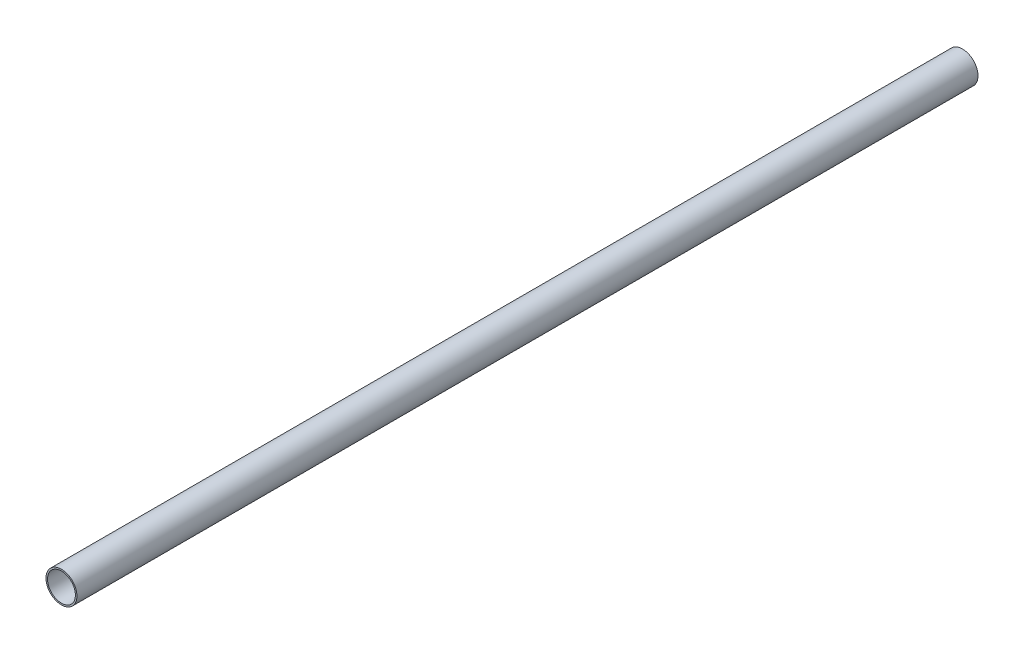
ISO-10303-21;
HEADER;
FILE_DESCRIPTION(('STEP AP214'),'2;1');
FILE_NAME('part.step','',(''),(''),'','','');
FILE_SCHEMA(('AUTOMOTIVE_DESIGN { 1 0 10303 214 1 1 1 1 }'));
ENDSEC;
DATA;
#1=APPLICATION_CONTEXT('core data for automotive mechanical design processes');
#2=APPLICATION_PROTOCOL_DEFINITION('international standard','automotive_design',2000,#1);
#3=PRODUCT_CONTEXT('',#1,'mechanical');
#4=PRODUCT('Part','Part','',(#3));
#5=PRODUCT_RELATED_PRODUCT_CATEGORY('part','',(#4));
#6=PRODUCT_DEFINITION_FORMATION('','',#4);
#7=PRODUCT_DEFINITION_CONTEXT('part definition',#1,'design');
#8=PRODUCT_DEFINITION('design','',#6,#7);
#9=PRODUCT_DEFINITION_SHAPE('','',#8);
#10=(LENGTH_UNIT() NAMED_UNIT(*) SI_UNIT(.MILLI.,.METRE.));
#11=(NAMED_UNIT(*) PLANE_ANGLE_UNIT() SI_UNIT($,.RADIAN.));
#12=(NAMED_UNIT(*) SI_UNIT($,.STERADIAN.) SOLID_ANGLE_UNIT());
#13=UNCERTAINTY_MEASURE_WITH_UNIT(LENGTH_MEASURE(1.E-05),#10,'distance_accuracy_value','');
#14=(GEOMETRIC_REPRESENTATION_CONTEXT(3) GLOBAL_UNCERTAINTY_ASSIGNED_CONTEXT((#13)) GLOBAL_UNIT_ASSIGNED_CONTEXT((#10,
#11,#12)) REPRESENTATION_CONTEXT('',''));
#15=CARTESIAN_POINT('',(0.,0.,0.));
#16=DIRECTION('',(0.,0.,1.));
#17=DIRECTION('',(1.,0.,0.));
#18=AXIS2_PLACEMENT_3D('',#15,#16,#17);
#19=CARTESIAN_POINT('',(0.,0.,-291.));
#20=DIRECTION('',(0.,0.,1.));
#21=DIRECTION('',(1.,0.,0.));
#22=AXIS2_PLACEMENT_3D('',#19,#20,#21);
#23=CYLINDRICAL_SURFACE('',#22,5.);
#24=CARTESIAN_POINT('',(0.,0.,-291.));
#25=DIRECTION('',(0.,0.,1.));
#26=DIRECTION('',(1.,0.,0.));
#27=AXIS2_PLACEMENT_3D('',#24,#25,#26);
#28=CIRCLE('',#27,5.);
#29=CARTESIAN_POINT('',(5.,0.,-291.));
#30=VERTEX_POINT('',#29);
#31=EDGE_CURVE('E11',#30,#30,#28,.T.);
#32=ORIENTED_EDGE('',*,*,#31,.T.);
#33=EDGE_LOOP('',(#32));
#34=FACE_BOUND('',#33,.T.);
#35=CARTESIAN_POINT('',(0.,0.,0.));
#36=DIRECTION('',(0.,0.,1.));
#37=DIRECTION('',(1.,0.,0.));
#38=AXIS2_PLACEMENT_3D('',#35,#36,#37);
#39=CIRCLE('',#38,5.);
#40=CARTESIAN_POINT('',(5.,0.,0.));
#41=VERTEX_POINT('',#40);
#42=EDGE_CURVE('E40',#41,#41,#39,.T.);
#43=ORIENTED_EDGE('',*,*,#42,.F.);
#44=EDGE_LOOP('',(#43));
#45=FACE_BOUND('',#44,.T.);
#46=ADVANCED_FACE('F37',(#34,#45),#23,.T.);
#47=CARTESIAN_POINT('',(0.,0.,-291.));
#48=DIRECTION('',(0.,0.,1.));
#49=DIRECTION('',(1.,0.,0.));
#50=AXIS2_PLACEMENT_3D('',#47,#48,#49);
#51=PLANE('',#50);
#52=CARTESIAN_POINT('',(0.,0.,-291.));
#53=DIRECTION('',(0.,0.,1.));
#54=DIRECTION('',(1.,0.,0.));
#55=AXIS2_PLACEMENT_3D('',#52,#53,#54);
#56=CIRCLE('',#55,4.5);
#57=CARTESIAN_POINT('',(4.5,0.,-291.));
#58=VERTEX_POINT('',#57);
#59=EDGE_CURVE('E47',#58,#58,#56,.T.);
#60=ORIENTED_EDGE('',*,*,#59,.T.);
#61=EDGE_LOOP('',(#60));
#62=FACE_BOUND('',#61,.T.);
#63=ORIENTED_EDGE('',*,*,#31,.F.);
#64=EDGE_LOOP('',(#63));
#65=FACE_BOUND('',#64,.T.);
#66=ADVANCED_FACE('F55',(#62,#65),#51,.F.);
#67=CARTESIAN_POINT('',(0.,0.,0.));
#68=DIRECTION('',(0.,0.,1.));
#69=DIRECTION('',(1.,0.,0.));
#70=AXIS2_PLACEMENT_3D('',#67,#68,#69);
#71=PLANE('',#70);
#72=CARTESIAN_POINT('',(0.,0.,0.));
#73=DIRECTION('',(0.,0.,1.));
#74=DIRECTION('',(1.,0.,0.));
#75=AXIS2_PLACEMENT_3D('',#72,#73,#74);
#76=CIRCLE('',#75,4.5);
#77=CARTESIAN_POINT('',(4.5,0.,0.));
#78=VERTEX_POINT('',#77);
#79=EDGE_CURVE('E49',#78,#78,#76,.T.);
#80=ORIENTED_EDGE('',*,*,#79,.F.);
#81=EDGE_LOOP('',(#80));
#82=FACE_BOUND('',#81,.T.);
#83=ORIENTED_EDGE('',*,*,#42,.T.);
#84=EDGE_LOOP('',(#83));
#85=FACE_BOUND('',#84,.T.);
#86=ADVANCED_FACE('F61',(#82,#85),#71,.T.);
#87=CARTESIAN_POINT('',(0.,0.,-291.));
#88=DIRECTION('',(0.,0.,1.));
#89=DIRECTION('',(1.,0.,0.));
#90=AXIS2_PLACEMENT_3D('',#87,#88,#89);
#91=CYLINDRICAL_SURFACE('',#90,4.5);
#92=ORIENTED_EDGE('',*,*,#59,.F.);
#93=EDGE_LOOP('',(#92));
#94=FACE_BOUND('',#93,.T.);
#95=ORIENTED_EDGE('',*,*,#79,.T.);
#96=EDGE_LOOP('',(#95));
#97=FACE_BOUND('',#96,.T.);
#98=ADVANCED_FACE('F58',(#94,#97),#91,.F.);
#99=CLOSED_SHELL('',(#46,#66,#86,#98));
#100=MANIFOLD_SOLID_BREP('B2',#99);
#101=ADVANCED_BREP_SHAPE_REPRESENTATION('',(#18,#100),#14);
#102=SHAPE_DEFINITION_REPRESENTATION(#9,#101);
ENDSEC;
END-ISO-10303-21;
